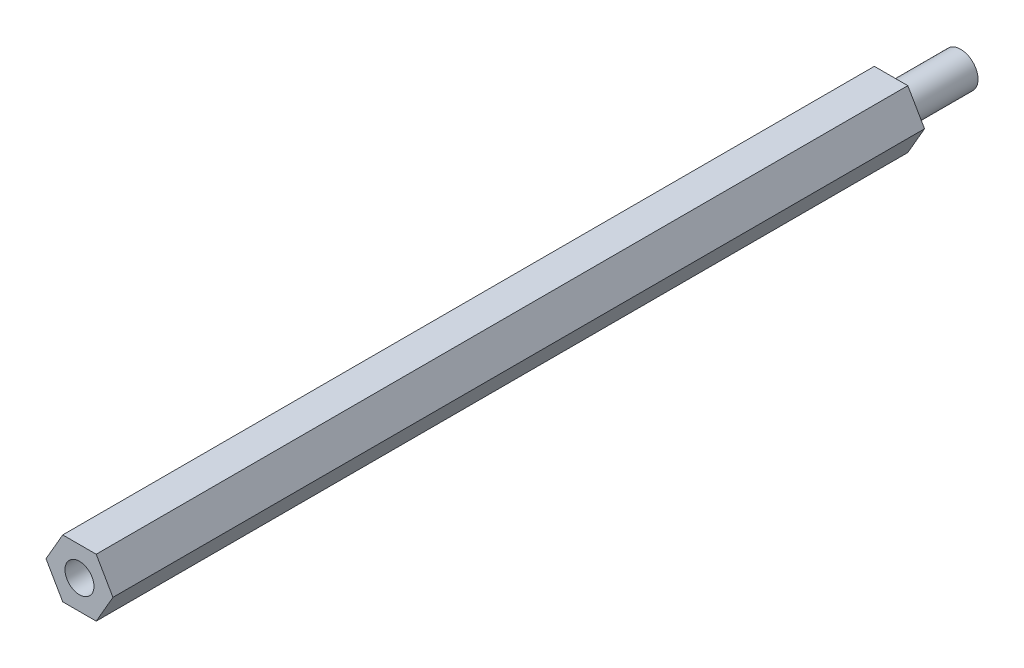
ISO-10303-21;
HEADER;
FILE_DESCRIPTION(('STEP AP214'),'2;1');
FILE_NAME('part.step','',(''),(''),'','','');
FILE_SCHEMA(('AUTOMOTIVE_DESIGN { 1 0 10303 214 1 1 1 1 }'));
ENDSEC;
DATA;
#1=APPLICATION_CONTEXT('core data for automotive mechanical design processes');
#2=APPLICATION_PROTOCOL_DEFINITION('international standard','automotive_design',2000,#1);
#3=PRODUCT_CONTEXT('',#1,'mechanical');
#4=PRODUCT('Part','Part','',(#3));
#5=PRODUCT_RELATED_PRODUCT_CATEGORY('part','',(#4));
#6=PRODUCT_DEFINITION_FORMATION('','',#4);
#7=PRODUCT_DEFINITION_CONTEXT('part definition',#1,'design');
#8=PRODUCT_DEFINITION('design','',#6,#7);
#9=PRODUCT_DEFINITION_SHAPE('','',#8);
#10=(LENGTH_UNIT() NAMED_UNIT(*) SI_UNIT(.MILLI.,.METRE.));
#11=(NAMED_UNIT(*) PLANE_ANGLE_UNIT() SI_UNIT($,.RADIAN.));
#12=(NAMED_UNIT(*) SI_UNIT($,.STERADIAN.) SOLID_ANGLE_UNIT());
#13=UNCERTAINTY_MEASURE_WITH_UNIT(LENGTH_MEASURE(1.E-05),#10,'distance_accuracy_value','');
#14=(GEOMETRIC_REPRESENTATION_CONTEXT(3) GLOBAL_UNCERTAINTY_ASSIGNED_CONTEXT((#13)) GLOBAL_UNIT_ASSIGNED_CONTEXT((#10,
#11,#12)) REPRESENTATION_CONTEXT('',''));
#15=CARTESIAN_POINT('',(0.,0.,0.));
#16=DIRECTION('',(0.,0.,1.));
#17=DIRECTION('',(1.,0.,0.));
#18=AXIS2_PLACEMENT_3D('',#15,#16,#17);
#19=CARTESIAN_POINT('',(1.44337567297406,2.5,70.));
#20=DIRECTION('',(0.,-1.,0.));
#21=DIRECTION('',(1.,0.,0.));
#22=AXIS2_PLACEMENT_3D('',#19,#20,#21);
#23=PLANE('',#22);
#24=DIRECTION('',(-1.,0.,0.));
#25=VECTOR('',#24,1.);
#26=CARTESIAN_POINT('',(1.44337567297406,2.5,0.));
#27=LINE('',#26,#25);
#28=CARTESIAN_POINT('',(1.44337567297406,2.5,0.));
#29=VERTEX_POINT('',#28);
#30=CARTESIAN_POINT('',(-1.44337567297407,2.5,0.));
#31=VERTEX_POINT('',#30);
#32=EDGE_CURVE('E121',#29,#31,#27,.T.);
#33=ORIENTED_EDGE('',*,*,#32,.T.);
#34=DIRECTION('',(0.,0.,-1.));
#35=VECTOR('',#34,1.);
#36=CARTESIAN_POINT('',(-1.44337567297407,2.5,70.));
#37=LINE('',#36,#35);
#38=CARTESIAN_POINT('',(-1.44337567297407,2.5,70.));
#39=VERTEX_POINT('',#38);
#40=EDGE_CURVE('E36',#39,#31,#37,.T.);
#41=ORIENTED_EDGE('',*,*,#40,.F.);
#42=DIRECTION('',(-1.,0.,0.));
#43=VECTOR('',#42,1.);
#44=CARTESIAN_POINT('',(1.44337567297406,2.5,70.));
#45=LINE('',#44,#43);
#46=CARTESIAN_POINT('',(1.44337567297406,2.5,70.));
#47=VERTEX_POINT('',#46);
#48=EDGE_CURVE('E132',#47,#39,#45,.T.);
#49=ORIENTED_EDGE('',*,*,#48,.F.);
#50=DIRECTION('',(0.,0.,-1.));
#51=VECTOR('',#50,1.);
#52=CARTESIAN_POINT('',(1.44337567297406,2.5,70.));
#53=LINE('',#52,#51);
#54=EDGE_CURVE('E117',#47,#29,#53,.T.);
#55=ORIENTED_EDGE('',*,*,#54,.T.);
#56=EDGE_LOOP('',(#33,#41,#49,#55));
#57=FACE_BOUND('',#56,.T.);
#58=ADVANCED_FACE('F33',(#57),#23,.F.);
#59=CARTESIAN_POINT('',(-1.44337567297407,2.5,70.));
#60=DIRECTION('',(0.866025403784439,-0.5,0.));
#61=DIRECTION('',(0.5,0.866025403784439,0.));
#62=AXIS2_PLACEMENT_3D('',#59,#60,#61);
#63=PLANE('',#62);
#64=DIRECTION('',(-0.5,-0.866025403784439,0.));
#65=VECTOR('',#64,1.);
#66=CARTESIAN_POINT('',(-1.44337567297407,2.5,0.));
#67=LINE('',#66,#65);
#68=CARTESIAN_POINT('',(-2.88675134594813,0.,0.));
#69=VERTEX_POINT('',#68);
#70=EDGE_CURVE('E124',#31,#69,#67,.T.);
#71=ORIENTED_EDGE('',*,*,#70,.T.);
#72=DIRECTION('',(0.,0.,-1.));
#73=VECTOR('',#72,1.);
#74=CARTESIAN_POINT('',(-2.88675134594813,0.,70.));
#75=LINE('',#74,#73);
#76=CARTESIAN_POINT('',(-2.88675134594813,0.,70.));
#77=VERTEX_POINT('',#76);
#78=EDGE_CURVE('E135',#77,#69,#75,.T.);
#79=ORIENTED_EDGE('',*,*,#78,.F.);
#80=DIRECTION('',(-0.5,-0.866025403784439,0.));
#81=VECTOR('',#80,1.);
#82=CARTESIAN_POINT('',(-1.44337567297407,2.5,70.));
#83=LINE('',#82,#81);
#84=EDGE_CURVE('E89',#39,#77,#83,.T.);
#85=ORIENTED_EDGE('',*,*,#84,.F.);
#86=ORIENTED_EDGE('',*,*,#40,.T.);
#87=EDGE_LOOP('',(#71,#79,#85,#86));
#88=FACE_BOUND('',#87,.T.);
#89=ADVANCED_FACE('F140',(#88),#63,.F.);
#90=CARTESIAN_POINT('',(-2.88675134594813,0.,70.));
#91=DIRECTION('',(0.866025403784438,0.5,0.));
#92=DIRECTION('',(-0.5,0.866025403784438,0.));
#93=AXIS2_PLACEMENT_3D('',#90,#91,#92);
#94=PLANE('',#93);
#95=DIRECTION('',(0.5,-0.866025403784438,0.));
#96=VECTOR('',#95,1.);
#97=CARTESIAN_POINT('',(-2.88675134594813,0.,0.));
#98=LINE('',#97,#96);
#99=CARTESIAN_POINT('',(-1.44337567297406,-2.5,0.));
#100=VERTEX_POINT('',#99);
#101=EDGE_CURVE('E127',#69,#100,#98,.T.);
#102=ORIENTED_EDGE('',*,*,#101,.T.);
#103=DIRECTION('',(0.,0.,-1.));
#104=VECTOR('',#103,1.);
#105=CARTESIAN_POINT('',(-1.44337567297406,-2.5,70.));
#106=LINE('',#105,#104);
#107=CARTESIAN_POINT('',(-1.44337567297406,-2.5,70.));
#108=VERTEX_POINT('',#107);
#109=EDGE_CURVE('E112',#108,#100,#106,.T.);
#110=ORIENTED_EDGE('',*,*,#109,.F.);
#111=DIRECTION('',(0.5,-0.866025403784438,0.));
#112=VECTOR('',#111,1.);
#113=CARTESIAN_POINT('',(-2.88675134594813,0.,70.));
#114=LINE('',#113,#112);
#115=EDGE_CURVE('E103',#77,#108,#114,.T.);
#116=ORIENTED_EDGE('',*,*,#115,.F.);
#117=ORIENTED_EDGE('',*,*,#78,.T.);
#118=EDGE_LOOP('',(#102,#110,#116,#117));
#119=FACE_BOUND('',#118,.T.);
#120=ADVANCED_FACE('F146',(#119),#94,.F.);
#121=CARTESIAN_POINT('',(-1.44337567297406,-2.5,70.));
#122=DIRECTION('',(0.,1.,0.));
#123=DIRECTION('',(-1.,0.,0.));
#124=AXIS2_PLACEMENT_3D('',#121,#122,#123);
#125=PLANE('',#124);
#126=DIRECTION('',(1.,0.,0.));
#127=VECTOR('',#126,1.);
#128=CARTESIAN_POINT('',(-1.44337567297406,-2.5,0.));
#129=LINE('',#128,#127);
#130=CARTESIAN_POINT('',(1.44337567297407,-2.5,0.));
#131=VERTEX_POINT('',#130);
#132=EDGE_CURVE('E111',#100,#131,#129,.T.);
#133=ORIENTED_EDGE('',*,*,#132,.T.);
#134=DIRECTION('',(0.,0.,-1.));
#135=VECTOR('',#134,1.);
#136=CARTESIAN_POINT('',(1.44337567297407,-2.5,70.));
#137=LINE('',#136,#135);
#138=CARTESIAN_POINT('',(1.44337567297407,-2.5,70.));
#139=VERTEX_POINT('',#138);
#140=EDGE_CURVE('E108',#139,#131,#137,.T.);
#141=ORIENTED_EDGE('',*,*,#140,.F.);
#142=DIRECTION('',(1.,0.,0.));
#143=VECTOR('',#142,1.);
#144=CARTESIAN_POINT('',(-1.44337567297406,-2.5,70.));
#145=LINE('',#144,#143);
#146=EDGE_CURVE('E97',#108,#139,#145,.T.);
#147=ORIENTED_EDGE('',*,*,#146,.F.);
#148=ORIENTED_EDGE('',*,*,#109,.T.);
#149=EDGE_LOOP('',(#133,#141,#147,#148));
#150=FACE_BOUND('',#149,.T.);
#151=ADVANCED_FACE('F109',(#150),#125,.F.);
#152=CARTESIAN_POINT('',(1.44337567297407,-2.5,70.));
#153=DIRECTION('',(-0.866025403784439,0.5,0.));
#154=DIRECTION('',(-0.5,-0.866025403784439,0.));
#155=AXIS2_PLACEMENT_3D('',#152,#153,#154);
#156=PLANE('',#155);
#157=DIRECTION('',(0.5,0.866025403784439,0.));
#158=VECTOR('',#157,1.);
#159=CARTESIAN_POINT('',(1.44337567297407,-2.5,0.));
#160=LINE('',#159,#158);
#161=CARTESIAN_POINT('',(2.88675134594813,0.,0.));
#162=VERTEX_POINT('',#161);
#163=EDGE_CURVE('E74',#131,#162,#160,.T.);
#164=ORIENTED_EDGE('',*,*,#163,.T.);
#165=DIRECTION('',(0.,0.,-1.));
#166=VECTOR('',#165,1.);
#167=CARTESIAN_POINT('',(2.88675134594813,0.,70.));
#168=LINE('',#167,#166);
#169=CARTESIAN_POINT('',(2.88675134594813,0.,70.));
#170=VERTEX_POINT('',#169);
#171=EDGE_CURVE('E113',#170,#162,#168,.T.);
#172=ORIENTED_EDGE('',*,*,#171,.F.);
#173=DIRECTION('',(0.5,0.866025403784439,0.));
#174=VECTOR('',#173,1.);
#175=CARTESIAN_POINT('',(1.44337567297407,-2.5,70.));
#176=LINE('',#175,#174);
#177=EDGE_CURVE('E101',#139,#170,#176,.T.);
#178=ORIENTED_EDGE('',*,*,#177,.F.);
#179=ORIENTED_EDGE('',*,*,#140,.T.);
#180=EDGE_LOOP('',(#164,#172,#178,#179));
#181=FACE_BOUND('',#180,.T.);
#182=ADVANCED_FACE('F115',(#181),#156,.F.);
#183=CARTESIAN_POINT('',(2.88675134594813,0.,70.));
#184=DIRECTION('',(-0.866025403784439,-0.5,0.));
#185=DIRECTION('',(0.5,-0.866025403784439,0.));
#186=AXIS2_PLACEMENT_3D('',#183,#184,#185);
#187=PLANE('',#186);
#188=DIRECTION('',(-0.5,0.866025403784439,0.));
#189=VECTOR('',#188,1.);
#190=CARTESIAN_POINT('',(2.88675134594813,0.,0.));
#191=LINE('',#190,#189);
#192=EDGE_CURVE('E80',#162,#29,#191,.T.);
#193=ORIENTED_EDGE('',*,*,#192,.T.);
#194=ORIENTED_EDGE('',*,*,#54,.F.);
#195=DIRECTION('',(-0.5,0.866025403784439,0.));
#196=VECTOR('',#195,1.);
#197=CARTESIAN_POINT('',(2.88675134594813,0.,70.));
#198=LINE('',#197,#196);
#199=EDGE_CURVE('E50',#170,#47,#198,.T.);
#200=ORIENTED_EDGE('',*,*,#199,.F.);
#201=ORIENTED_EDGE('',*,*,#171,.T.);
#202=EDGE_LOOP('',(#193,#194,#200,#201));
#203=FACE_BOUND('',#202,.T.);
#204=ADVANCED_FACE('F162',(#203),#187,.F.);
#205=CARTESIAN_POINT('',(0.,0.,70.));
#206=DIRECTION('',(0.,0.,1.));
#207=DIRECTION('',(1.,0.,0.));
#208=AXIS2_PLACEMENT_3D('',#205,#206,#207);
#209=PLANE('',#208);
#210=CARTESIAN_POINT('',(0.,0.,70.));
#211=DIRECTION('',(0.,0.,1.));
#212=DIRECTION('',(1.,0.,0.));
#213=AXIS2_PLACEMENT_3D('',#210,#211,#212);
#214=CIRCLE('',#213,1.24999999999999);
#215=CARTESIAN_POINT('',(1.24999999999999,0.,70.));
#216=VERTEX_POINT('',#215);
#217=EDGE_CURVE('E155',#216,#216,#214,.T.);
#218=ORIENTED_EDGE('',*,*,#217,.F.);
#219=EDGE_LOOP('',(#218));
#220=FACE_BOUND('',#219,.T.);
#221=ORIENTED_EDGE('',*,*,#48,.T.);
#222=ORIENTED_EDGE('',*,*,#84,.T.);
#223=ORIENTED_EDGE('',*,*,#115,.T.);
#224=ORIENTED_EDGE('',*,*,#146,.T.);
#225=ORIENTED_EDGE('',*,*,#177,.T.);
#226=ORIENTED_EDGE('',*,*,#199,.T.);
#227=EDGE_LOOP('',(#221,#222,#223,#224,#225,#226));
#228=FACE_BOUND('',#227,.T.);
#229=ADVANCED_FACE('F99',(#220,#228),#209,.T.);
#230=CARTESIAN_POINT('',(0.,0.,0.));
#231=DIRECTION('',(0.,0.,1.));
#232=DIRECTION('',(1.,0.,0.));
#233=AXIS2_PLACEMENT_3D('',#230,#231,#232);
#234=PLANE('',#233);
#235=CARTESIAN_POINT('',(0.,0.,0.));
#236=DIRECTION('',(0.,0.,-1.));
#237=DIRECTION('',(-1.,0.,0.));
#238=AXIS2_PLACEMENT_3D('',#235,#236,#237);
#239=CIRCLE('',#238,1.5);
#240=CARTESIAN_POINT('',(-1.5,0.,0.));
#241=VERTEX_POINT('',#240);
#242=EDGE_CURVE('E11',#241,#241,#239,.T.);
#243=ORIENTED_EDGE('',*,*,#242,.F.);
#244=EDGE_LOOP('',(#243));
#245=FACE_BOUND('',#244,.T.);
#246=ORIENTED_EDGE('',*,*,#32,.F.);
#247=ORIENTED_EDGE('',*,*,#192,.F.);
#248=ORIENTED_EDGE('',*,*,#163,.F.);
#249=ORIENTED_EDGE('',*,*,#132,.F.);
#250=ORIENTED_EDGE('',*,*,#101,.F.);
#251=ORIENTED_EDGE('',*,*,#70,.F.);
#252=EDGE_LOOP('',(#246,#247,#248,#249,#250,#251));
#253=FACE_BOUND('',#252,.T.);
#254=ADVANCED_FACE('F145',(#245,#253),#234,.F.);
#255=CARTESIAN_POINT('',(0.,0.,-6.));
#256=DIRECTION('',(0.,0.,1.));
#257=DIRECTION('',(1.,0.,0.));
#258=AXIS2_PLACEMENT_3D('',#255,#256,#257);
#259=CYLINDRICAL_SURFACE('',#258,1.5);
#260=CARTESIAN_POINT('',(0.,0.,-6.));
#261=DIRECTION('',(0.,0.,-1.));
#262=DIRECTION('',(-1.,0.,0.));
#263=AXIS2_PLACEMENT_3D('',#260,#261,#262);
#264=CIRCLE('',#263,1.5);
#265=CARTESIAN_POINT('',(-1.5,0.,-6.));
#266=VERTEX_POINT('',#265);
#267=EDGE_CURVE('E125',#266,#266,#264,.T.);
#268=ORIENTED_EDGE('',*,*,#267,.F.);
#269=EDGE_LOOP('',(#268));
#270=FACE_BOUND('',#269,.T.);
#271=ORIENTED_EDGE('',*,*,#242,.T.);
#272=EDGE_LOOP('',(#271));
#273=FACE_BOUND('',#272,.T.);
#274=ADVANCED_FACE('F168',(#270,#273),#259,.T.);
#275=CARTESIAN_POINT('',(0.,0.,-6.));
#276=DIRECTION('',(0.,0.,-1.));
#277=DIRECTION('',(-1.,0.,0.));
#278=AXIS2_PLACEMENT_3D('',#275,#276,#277);
#279=PLANE('',#278);
#280=ORIENTED_EDGE('',*,*,#267,.T.);
#281=EDGE_LOOP('',(#280));
#282=FACE_BOUND('',#281,.T.);
#283=ADVANCED_FACE('F209',(#282),#279,.T.);
#284=CARTESIAN_POINT('',(0.,0.,62.5));
#285=DIRECTION('',(0.,0.,1.));
#286=DIRECTION('',(1.,0.,0.));
#287=AXIS2_PLACEMENT_3D('',#284,#285,#286);
#288=CONICAL_SURFACE('',#287,1.25,1.02974425867666);
#289=CARTESIAN_POINT('',(0.,0.,61.7489242262156));
#290=VERTEX_POINT('',#289);
#291=VERTEX_LOOP('',#290);
#292=FACE_BOUND('',#291,.T.);
#293=CARTESIAN_POINT('',(0.,0.,62.5));
#294=DIRECTION('',(0.,0.,1.));
#295=DIRECTION('',(1.,0.,0.));
#296=AXIS2_PLACEMENT_3D('',#293,#294,#295);
#297=CIRCLE('',#296,1.25);
#298=CARTESIAN_POINT('',(1.25,0.,62.5));
#299=VERTEX_POINT('',#298);
#300=EDGE_CURVE('E152',#299,#299,#297,.T.);
#301=ORIENTED_EDGE('',*,*,#300,.T.);
#302=EDGE_LOOP('',(#301));
#303=FACE_BOUND('',#302,.T.);
#304=ADVANCED_FACE('F217',(#292,#303),#288,.F.);
#305=CARTESIAN_POINT('',(0.,0.,70.));
#306=DIRECTION('',(0.,0.,1.));
#307=DIRECTION('',(1.,0.,0.));
#308=AXIS2_PLACEMENT_3D('',#305,#306,#307);
#309=CYLINDRICAL_SURFACE('',#308,1.24999999999999);
#310=ORIENTED_EDGE('',*,*,#300,.F.);
#311=EDGE_LOOP('',(#310));
#312=FACE_BOUND('',#311,.T.);
#313=ORIENTED_EDGE('',*,*,#217,.T.);
#314=EDGE_LOOP('',(#313));
#315=FACE_BOUND('',#314,.T.);
#316=ADVANCED_FACE('F159',(#312,#315),#309,.F.);
#317=CLOSED_SHELL('',(#58,#89,#120,#151,#182,#204,#229,#254,#274,#283,#304,#316));
#318=MANIFOLD_SOLID_BREP('B2',#317);
#319=ADVANCED_BREP_SHAPE_REPRESENTATION('',(#18,#318),#14);
#320=SHAPE_DEFINITION_REPRESENTATION(#9,#319);
ENDSEC;
END-ISO-10303-21;
